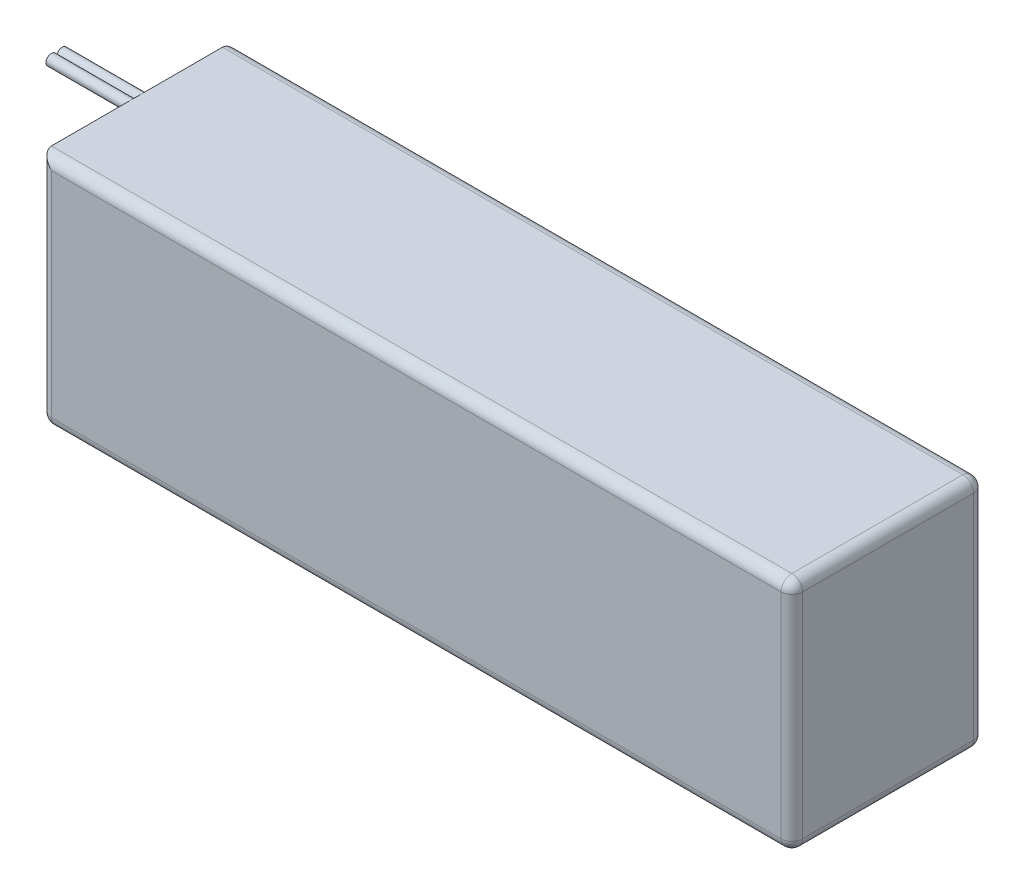
ISO-10303-21;
HEADER;
FILE_DESCRIPTION(('STEP AP214'),'2;1');
FILE_NAME('part.step','',(''),(''),'','','');
FILE_SCHEMA(('AUTOMOTIVE_DESIGN { 1 0 10303 214 1 1 1 1 }'));
ENDSEC;
DATA;
#1=APPLICATION_CONTEXT('core data for automotive mechanical design processes');
#2=APPLICATION_PROTOCOL_DEFINITION('international standard','automotive_design',2000,#1);
#3=PRODUCT_CONTEXT('',#1,'mechanical');
#4=PRODUCT('Part','Part','',(#3));
#5=PRODUCT_RELATED_PRODUCT_CATEGORY('part','',(#4));
#6=PRODUCT_DEFINITION_FORMATION('','',#4);
#7=PRODUCT_DEFINITION_CONTEXT('part definition',#1,'design');
#8=PRODUCT_DEFINITION('design','',#6,#7);
#9=PRODUCT_DEFINITION_SHAPE('','',#8);
#10=(LENGTH_UNIT() NAMED_UNIT(*) SI_UNIT(.MILLI.,.METRE.));
#11=(NAMED_UNIT(*) PLANE_ANGLE_UNIT() SI_UNIT($,.RADIAN.));
#12=(NAMED_UNIT(*) SI_UNIT($,.STERADIAN.) SOLID_ANGLE_UNIT());
#13=UNCERTAINTY_MEASURE_WITH_UNIT(LENGTH_MEASURE(1.E-05),#10,'distance_accuracy_value','');
#14=(GEOMETRIC_REPRESENTATION_CONTEXT(3) GLOBAL_UNCERTAINTY_ASSIGNED_CONTEXT((#13)) GLOBAL_UNIT_ASSIGNED_CONTEXT((#10,
#11,#12)) REPRESENTATION_CONTEXT('',''));
#15=CARTESIAN_POINT('',(0.,0.,0.));
#16=DIRECTION('',(0.,0.,1.));
#17=DIRECTION('',(1.,0.,0.));
#18=AXIS2_PLACEMENT_3D('',#15,#16,#17);
#19=CARTESIAN_POINT('',(-85.25,21.,19.005));
#20=DIRECTION('',(1.,0.,0.));
#21=DIRECTION('',(0.,0.,-1.));
#22=AXIS2_PLACEMENT_3D('',#19,#20,#21);
#23=CYLINDRICAL_SURFACE('',#22,1.);
#24=CARTESIAN_POINT('',(-85.25,21.,19.005));
#25=DIRECTION('',(-1.,0.,0.));
#26=DIRECTION('',(0.,0.,1.));
#27=AXIS2_PLACEMENT_3D('',#24,#25,#26);
#28=CIRCLE('',#27,1.);
#29=CARTESIAN_POINT('',(-85.25,21.,20.005));
#30=VERTEX_POINT('',#29);
#31=EDGE_CURVE('E56',#30,#30,#28,.T.);
#32=ORIENTED_EDGE('',*,*,#31,.F.);
#33=EDGE_LOOP('',(#32));
#34=FACE_BOUND('',#33,.T.);
#35=CARTESIAN_POINT('',(-70.25,21.,19.005));
#36=DIRECTION('',(-1.,0.,0.));
#37=DIRECTION('',(0.,0.,1.));
#38=AXIS2_PLACEMENT_3D('',#35,#36,#37);
#39=CIRCLE('',#38,1.);
#40=CARTESIAN_POINT('',(-70.25,21.,20.005));
#41=VERTEX_POINT('',#40);
#42=EDGE_CURVE('E11',#41,#41,#39,.T.);
#43=ORIENTED_EDGE('',*,*,#42,.T.);
#44=EDGE_LOOP('',(#43));
#45=FACE_BOUND('',#44,.T.);
#46=ADVANCED_FACE('F52',(#34,#45),#23,.T.);
#47=CARTESIAN_POINT('',(-85.25,21.,19.005));
#48=DIRECTION('',(-1.,0.,0.));
#49=DIRECTION('',(0.,0.,1.));
#50=AXIS2_PLACEMENT_3D('',#47,#48,#49);
#51=PLANE('',#50);
#52=ORIENTED_EDGE('',*,*,#31,.T.);
#53=EDGE_LOOP('',(#52));
#54=FACE_BOUND('',#53,.T.);
#55=ADVANCED_FACE('F54',(#54),#51,.T.);
#56=CARTESIAN_POINT('',(-70.25,21.,19.005));
#57=DIRECTION('',(-1.,0.,0.));
#58=DIRECTION('',(0.,0.,1.));
#59=AXIS2_PLACEMENT_3D('',#56,#57,#58);
#60=PLANE('',#59);
#61=ORIENTED_EDGE('',*,*,#42,.F.);
#62=EDGE_LOOP('',(#61));
#63=FACE_BOUND('',#62,.T.);
#64=ADVANCED_FACE('F71',(#63),#60,.F.);
#65=CLOSED_SHELL('',(#46,#55,#64));
#66=MANIFOLD_SOLID_BREP('B2',#65);
#67=CARTESIAN_POINT('',(-85.25,21.,16.995));
#68=DIRECTION('',(1.,0.,0.));
#69=DIRECTION('',(0.,0.,-1.));
#70=AXIS2_PLACEMENT_3D('',#67,#68,#69);
#71=CYLINDRICAL_SURFACE('',#70,1.);
#72=CARTESIAN_POINT('',(-85.25,21.,16.995));
#73=DIRECTION('',(-1.,0.,0.));
#74=DIRECTION('',(0.,0.,1.));
#75=AXIS2_PLACEMENT_3D('',#72,#73,#74);
#76=CIRCLE('',#75,1.);
#77=CARTESIAN_POINT('',(-85.25,21.,17.995));
#78=VERTEX_POINT('',#77);
#79=EDGE_CURVE('E51',#78,#78,#76,.T.);
#80=ORIENTED_EDGE('',*,*,#79,.F.);
#81=EDGE_LOOP('',(#80));
#82=FACE_BOUND('',#81,.T.);
#83=CARTESIAN_POINT('',(-70.25,21.,16.995));
#84=DIRECTION('',(-1.,0.,0.));
#85=DIRECTION('',(0.,0.,1.));
#86=AXIS2_PLACEMENT_3D('',#83,#84,#85);
#87=CIRCLE('',#86,1.);
#88=CARTESIAN_POINT('',(-70.25,21.,17.995));
#89=VERTEX_POINT('',#88);
#90=EDGE_CURVE('E105',#89,#89,#87,.T.);
#91=ORIENTED_EDGE('',*,*,#90,.T.);
#92=EDGE_LOOP('',(#91));
#93=FACE_BOUND('',#92,.T.);
#94=ADVANCED_FACE('F102',(#82,#93),#71,.T.);
#95=CARTESIAN_POINT('',(-85.25,21.,16.995));
#96=DIRECTION('',(-1.,0.,0.));
#97=DIRECTION('',(0.,0.,1.));
#98=AXIS2_PLACEMENT_3D('',#95,#96,#97);
#99=PLANE('',#98);
#100=ORIENTED_EDGE('',*,*,#79,.T.);
#101=EDGE_LOOP('',(#100));
#102=FACE_BOUND('',#101,.T.);
#103=ADVANCED_FACE('F117',(#102),#99,.T.);
#104=CARTESIAN_POINT('',(-70.25,21.,16.995));
#105=DIRECTION('',(-1.,0.,0.));
#106=DIRECTION('',(0.,0.,1.));
#107=AXIS2_PLACEMENT_3D('',#104,#105,#106);
#108=PLANE('',#107);
#109=ORIENTED_EDGE('',*,*,#90,.F.);
#110=EDGE_LOOP('',(#109));
#111=FACE_BOUND('',#110,.T.);
#112=ADVANCED_FACE('F115',(#111),#108,.F.);
#113=CLOSED_SHELL('',(#94,#103,#112));
#114=MANIFOLD_SOLID_BREP('B6',#113);
#115=CARTESIAN_POINT('',(70.25,-22.,36.));
#116=DIRECTION('',(-1.,0.,0.));
#117=DIRECTION('',(0.,0.,1.));
#118=AXIS2_PLACEMENT_3D('',#115,#116,#117);
#119=PLANE('',#118);
#120=DIRECTION('',(0.,0.,-1.));
#121=VECTOR('',#120,1.);
#122=CARTESIAN_POINT('',(70.25,-20.,36.));
#123=LINE('',#122,#121);
#124=CARTESIAN_POINT('',(70.25,-20.,34.));
#125=VERTEX_POINT('',#124);
#126=CARTESIAN_POINT('',(70.25,-20.,2.));
#127=VERTEX_POINT('',#126);
#128=EDGE_CURVE('E245',#125,#127,#123,.T.);
#129=ORIENTED_EDGE('',*,*,#128,.T.);
#130=DIRECTION('',(0.,1.,0.));
#131=VECTOR('',#130,1.);
#132=CARTESIAN_POINT('',(70.25,22.,2.));
#133=LINE('',#132,#131);
#134=CARTESIAN_POINT('',(70.25,20.,2.));
#135=VERTEX_POINT('',#134);
#136=EDGE_CURVE('E282',#127,#135,#133,.T.);
#137=ORIENTED_EDGE('',*,*,#136,.T.);
#138=DIRECTION('',(0.,0.,-1.));
#139=VECTOR('',#138,1.);
#140=CARTESIAN_POINT('',(70.25,20.,36.));
#141=LINE('',#140,#139);
#142=CARTESIAN_POINT('',(70.25,20.,34.));
#143=VERTEX_POINT('',#142);
#144=EDGE_CURVE('E279',#135,#143,#141,.F.);
#145=ORIENTED_EDGE('',*,*,#144,.T.);
#146=DIRECTION('',(0.,1.,0.));
#147=VECTOR('',#146,1.);
#148=CARTESIAN_POINT('',(70.25,-22.,34.));
#149=LINE('',#148,#147);
#150=EDGE_CURVE('E277',#143,#125,#149,.F.);
#151=ORIENTED_EDGE('',*,*,#150,.T.);
#152=EDGE_LOOP('',(#129,#137,#145,#151));
#153=FACE_BOUND('',#152,.T.);
#154=ADVANCED_FACE('F143',(#153),#119,.F.);
#155=CARTESIAN_POINT('',(-70.25,22.,36.));
#156=DIRECTION('',(0.,-1.,0.));
#157=DIRECTION('',(0.,0.,-1.));
#158=AXIS2_PLACEMENT_3D('',#155,#156,#157);
#159=PLANE('',#158);
#160=DIRECTION('',(0.,0.,-1.));
#161=VECTOR('',#160,1.);
#162=CARTESIAN_POINT('',(68.25,22.,36.));
#163=LINE('',#162,#161);
#164=CARTESIAN_POINT('',(68.25,22.,34.));
#165=VERTEX_POINT('',#164);
#166=CARTESIAN_POINT('',(68.25,22.,2.));
#167=VERTEX_POINT('',#166);
#168=EDGE_CURVE('E286',#165,#167,#163,.T.);
#169=ORIENTED_EDGE('',*,*,#168,.T.);
#170=DIRECTION('',(-1.,0.,0.));
#171=VECTOR('',#170,1.);
#172=CARTESIAN_POINT('',(-70.25,22.,2.));
#173=LINE('',#172,#171);
#174=CARTESIAN_POINT('',(-70.25,22.,2.));
#175=VERTEX_POINT('',#174);
#176=EDGE_CURVE('E288',#167,#175,#173,.T.);
#177=ORIENTED_EDGE('',*,*,#176,.T.);
#178=DIRECTION('',(0.,0.,-1.));
#179=VECTOR('',#178,1.);
#180=CARTESIAN_POINT('',(-70.25,22.,36.));
#181=LINE('',#180,#179);
#182=CARTESIAN_POINT('',(-70.25,22.,34.));
#183=VERTEX_POINT('',#182);
#184=EDGE_CURVE('E263',#183,#175,#181,.T.);
#185=ORIENTED_EDGE('',*,*,#184,.F.);
#186=DIRECTION('',(-1.,0.,0.));
#187=VECTOR('',#186,1.);
#188=CARTESIAN_POINT('',(-70.25,22.,34.));
#189=LINE('',#188,#187);
#190=EDGE_CURVE('E284',#183,#165,#189,.F.);
#191=ORIENTED_EDGE('',*,*,#190,.T.);
#192=EDGE_LOOP('',(#169,#177,#185,#191));
#193=FACE_BOUND('',#192,.T.);
#194=ADVANCED_FACE('F396',(#193),#159,.F.);
#195=CARTESIAN_POINT('',(-70.25,-22.,36.));
#196=DIRECTION('',(1.,0.,0.));
#197=DIRECTION('',(0.,0.,-1.));
#198=AXIS2_PLACEMENT_3D('',#195,#196,#197);
#199=PLANE('',#198);
#200=ORIENTED_EDGE('',*,*,#184,.T.);
#201=DIRECTION('',(0.,-1.,0.));
#202=VECTOR('',#201,1.);
#203=CARTESIAN_POINT('',(-70.25,-22.,2.));
#204=LINE('',#203,#202);
#205=CARTESIAN_POINT('',(-70.25,-20.,2.));
#206=VERTEX_POINT('',#205);
#207=EDGE_CURVE('E275',#175,#206,#204,.T.);
#208=ORIENTED_EDGE('',*,*,#207,.T.);
#209=DIRECTION('',(0.,0.,-1.));
#210=VECTOR('',#209,1.);
#211=CARTESIAN_POINT('',(-70.25,-20.,36.));
#212=LINE('',#211,#210);
#213=CARTESIAN_POINT('',(-70.25,-20.,34.));
#214=VERTEX_POINT('',#213);
#215=EDGE_CURVE('E272',#206,#214,#212,.F.);
#216=ORIENTED_EDGE('',*,*,#215,.T.);
#217=DIRECTION('',(0.,-1.,0.));
#218=VECTOR('',#217,1.);
#219=CARTESIAN_POINT('',(-70.25,-22.,34.));
#220=LINE('',#219,#218);
#221=EDGE_CURVE('E270',#214,#183,#220,.F.);
#222=ORIENTED_EDGE('',*,*,#221,.T.);
#223=EDGE_LOOP('',(#200,#208,#216,#222));
#224=FACE_BOUND('',#223,.T.);
#225=ADVANCED_FACE('F393',(#224),#199,.F.);
#226=CARTESIAN_POINT('',(-70.25,-22.,36.));
#227=DIRECTION('',(0.,1.,0.));
#228=DIRECTION('',(0.,0.,1.));
#229=AXIS2_PLACEMENT_3D('',#226,#227,#228);
#230=PLANE('',#229);
#231=DIRECTION('',(0.,0.,-1.));
#232=VECTOR('',#231,1.);
#233=CARTESIAN_POINT('',(-68.25,-22.,36.));
#234=LINE('',#233,#232);
#235=CARTESIAN_POINT('',(-68.25,-22.,34.));
#236=VERTEX_POINT('',#235);
#237=CARTESIAN_POINT('',(-68.25,-22.,2.));
#238=VERTEX_POINT('',#237);
#239=EDGE_CURVE('E237',#236,#238,#234,.T.);
#240=ORIENTED_EDGE('',*,*,#239,.T.);
#241=DIRECTION('',(1.,0.,0.));
#242=VECTOR('',#241,1.);
#243=CARTESIAN_POINT('',(70.25,-22.,2.));
#244=LINE('',#243,#242);
#245=CARTESIAN_POINT('',(68.25,-22.,2.));
#246=VERTEX_POINT('',#245);
#247=EDGE_CURVE('E233',#238,#246,#244,.T.);
#248=ORIENTED_EDGE('',*,*,#247,.T.);
#249=DIRECTION('',(0.,0.,-1.));
#250=VECTOR('',#249,1.);
#251=CARTESIAN_POINT('',(68.25,-22.,36.));
#252=LINE('',#251,#250);
#253=CARTESIAN_POINT('',(68.25,-22.,34.));
#254=VERTEX_POINT('',#253);
#255=EDGE_CURVE('E225',#246,#254,#252,.F.);
#256=ORIENTED_EDGE('',*,*,#255,.T.);
#257=DIRECTION('',(1.,0.,0.));
#258=VECTOR('',#257,1.);
#259=CARTESIAN_POINT('',(-70.25,-22.,34.));
#260=LINE('',#259,#258);
#261=EDGE_CURVE('E230',#254,#236,#260,.F.);
#262=ORIENTED_EDGE('',*,*,#261,.T.);
#263=EDGE_LOOP('',(#240,#248,#256,#262));
#264=FACE_BOUND('',#263,.T.);
#265=ADVANCED_FACE('F228',(#264),#230,.F.);
#266=CARTESIAN_POINT('',(0.,0.,36.));
#267=DIRECTION('',(0.,0.,-1.));
#268=DIRECTION('',(-1.,0.,0.));
#269=AXIS2_PLACEMENT_3D('',#266,#267,#268);
#270=PLANE('',#269);
#271=DIRECTION('',(0.,-1.,0.));
#272=VECTOR('',#271,1.);
#273=CARTESIAN_POINT('',(-68.25,0.,36.));
#274=LINE('',#273,#272);
#275=CARTESIAN_POINT('',(-68.25,20.,36.));
#276=VERTEX_POINT('',#275);
#277=CARTESIAN_POINT('',(-68.25,-20.,36.));
#278=VERTEX_POINT('',#277);
#279=EDGE_CURVE('E152',#276,#278,#274,.T.);
#280=ORIENTED_EDGE('',*,*,#279,.T.);
#281=DIRECTION('',(1.,0.,0.));
#282=VECTOR('',#281,1.);
#283=CARTESIAN_POINT('',(0.,-20.,36.));
#284=LINE('',#283,#282);
#285=CARTESIAN_POINT('',(68.25,-20.,36.));
#286=VERTEX_POINT('',#285);
#287=EDGE_CURVE('E100',#278,#286,#284,.T.);
#288=ORIENTED_EDGE('',*,*,#287,.T.);
#289=DIRECTION('',(0.,1.,0.));
#290=VECTOR('',#289,1.);
#291=CARTESIAN_POINT('',(68.25,0.,36.));
#292=LINE('',#291,#290);
#293=CARTESIAN_POINT('',(68.25,20.,36.));
#294=VERTEX_POINT('',#293);
#295=EDGE_CURVE('E299',#286,#294,#292,.T.);
#296=ORIENTED_EDGE('',*,*,#295,.T.);
#297=DIRECTION('',(-1.,0.,0.));
#298=VECTOR('',#297,1.);
#299=CARTESIAN_POINT('',(0.,20.,36.));
#300=LINE('',#299,#298);
#301=EDGE_CURVE('E163',#294,#276,#300,.T.);
#302=ORIENTED_EDGE('',*,*,#301,.T.);
#303=EDGE_LOOP('',(#280,#288,#296,#302));
#304=FACE_BOUND('',#303,.T.);
#305=ADVANCED_FACE('F383',(#304),#270,.F.);
#306=CARTESIAN_POINT('',(0.,0.,0.));
#307=DIRECTION('',(0.,0.,-1.));
#308=DIRECTION('',(-1.,0.,0.));
#309=AXIS2_PLACEMENT_3D('',#306,#307,#308);
#310=PLANE('',#309);
#311=DIRECTION('',(0.,-1.,0.));
#312=VECTOR('',#311,1.);
#313=CARTESIAN_POINT('',(-68.25,22.,0.));
#314=LINE('',#313,#312);
#315=CARTESIAN_POINT('',(-68.25,-20.,0.));
#316=VERTEX_POINT('',#315);
#317=CARTESIAN_POINT('',(-68.25,20.,0.));
#318=VERTEX_POINT('',#317);
#319=EDGE_CURVE('E294',#316,#318,#314,.F.);
#320=ORIENTED_EDGE('',*,*,#319,.T.);
#321=DIRECTION('',(-1.,0.,0.));
#322=VECTOR('',#321,1.);
#323=CARTESIAN_POINT('',(70.25,20.,0.));
#324=LINE('',#323,#322);
#325=CARTESIAN_POINT('',(68.25,20.,0.));
#326=VERTEX_POINT('',#325);
#327=EDGE_CURVE('E296',#318,#326,#324,.F.);
#328=ORIENTED_EDGE('',*,*,#327,.T.);
#329=DIRECTION('',(0.,1.,0.));
#330=VECTOR('',#329,1.);
#331=CARTESIAN_POINT('',(68.25,-22.,0.));
#332=LINE('',#331,#330);
#333=CARTESIAN_POINT('',(68.25,-20.,0.));
#334=VERTEX_POINT('',#333);
#335=EDGE_CURVE('E290',#326,#334,#332,.F.);
#336=ORIENTED_EDGE('',*,*,#335,.T.);
#337=DIRECTION('',(1.,0.,0.));
#338=VECTOR('',#337,1.);
#339=CARTESIAN_POINT('',(-70.25,-20.,0.));
#340=LINE('',#339,#338);
#341=EDGE_CURVE('E292',#334,#316,#340,.F.);
#342=ORIENTED_EDGE('',*,*,#341,.T.);
#343=EDGE_LOOP('',(#320,#328,#336,#342));
#344=FACE_BOUND('',#343,.T.);
#345=ADVANCED_FACE('F385',(#344),#310,.T.);
#346=CARTESIAN_POINT('',(68.25,20.,36.));
#347=DIRECTION('',(0.,0.,-1.));
#348=DIRECTION('',(-1.,0.,0.));
#349=AXIS2_PLACEMENT_3D('',#346,#347,#348);
#350=CYLINDRICAL_SURFACE('',#349,2.);
#351=CARTESIAN_POINT('',(68.25,20.,34.));
#352=DIRECTION('',(0.,0.,1.));
#353=DIRECTION('',(1.,0.,0.));
#354=AXIS2_PLACEMENT_3D('',#351,#352,#353);
#355=CIRCLE('',#354,2.);
#356=EDGE_CURVE('E147',#143,#165,#355,.T.);
#357=ORIENTED_EDGE('',*,*,#356,.F.);
#358=ORIENTED_EDGE('',*,*,#144,.F.);
#359=CARTESIAN_POINT('',(68.25,20.,2.));
#360=DIRECTION('',(0.,0.,-1.));
#361=DIRECTION('',(-1.,0.,0.));
#362=AXIS2_PLACEMENT_3D('',#359,#360,#361);
#363=CIRCLE('',#362,2.);
#364=EDGE_CURVE('E333',#167,#135,#363,.T.);
#365=ORIENTED_EDGE('',*,*,#364,.F.);
#366=ORIENTED_EDGE('',*,*,#168,.F.);
#367=EDGE_LOOP('',(#357,#358,#365,#366));
#368=FACE_BOUND('',#367,.T.);
#369=ADVANCED_FACE('F145',(#368),#350,.T.);
#370=CARTESIAN_POINT('',(68.25,20.,34.));
#371=DIRECTION('',(1.,0.,0.));
#372=DIRECTION('',(0.,0.,-1.));
#373=AXIS2_PLACEMENT_3D('',#370,#371,#372);
#374=SPHERICAL_SURFACE('',#373,2.);
#375=CARTESIAN_POINT('',(68.25,20.,34.));
#376=DIRECTION('',(1.,0.,0.));
#377=DIRECTION('',(0.,0.,-1.));
#378=AXIS2_PLACEMENT_3D('',#375,#376,#377);
#379=CIRCLE('',#378,2.);
#380=EDGE_CURVE('E330',#294,#165,#379,.F.);
#381=ORIENTED_EDGE('',*,*,#380,.F.);
#382=CARTESIAN_POINT('',(68.25,20.,34.));
#383=DIRECTION('',(0.,1.,0.));
#384=DIRECTION('',(0.,0.,1.));
#385=AXIS2_PLACEMENT_3D('',#382,#383,#384);
#386=CIRCLE('',#385,2.);
#387=EDGE_CURVE('E338',#143,#294,#386,.F.);
#388=ORIENTED_EDGE('',*,*,#387,.F.);
#389=ORIENTED_EDGE('',*,*,#356,.T.);
#390=EDGE_LOOP('',(#381,#388,#389));
#391=FACE_BOUND('',#390,.T.);
#392=ADVANCED_FACE('F347',(#391),#374,.T.);
#393=CARTESIAN_POINT('',(68.25,0.,34.));
#394=DIRECTION('',(0.,1.,0.));
#395=DIRECTION('',(0.,0.,1.));
#396=AXIS2_PLACEMENT_3D('',#393,#394,#395);
#397=CYLINDRICAL_SURFACE('',#396,2.);
#398=ORIENTED_EDGE('',*,*,#387,.T.);
#399=ORIENTED_EDGE('',*,*,#295,.F.);
#400=CARTESIAN_POINT('',(68.25,-20.,34.));
#401=DIRECTION('',(0.,-1.,0.));
#402=DIRECTION('',(0.,0.,-1.));
#403=AXIS2_PLACEMENT_3D('',#400,#401,#402);
#404=CIRCLE('',#403,2.);
#405=EDGE_CURVE('E249',#125,#286,#404,.T.);
#406=ORIENTED_EDGE('',*,*,#405,.F.);
#407=ORIENTED_EDGE('',*,*,#150,.F.);
#408=EDGE_LOOP('',(#398,#399,#406,#407));
#409=FACE_BOUND('',#408,.T.);
#410=ADVANCED_FACE('F382',(#409),#397,.T.);
#411=CARTESIAN_POINT('',(68.25,-20.,36.));
#412=DIRECTION('',(0.,0.,-1.));
#413=DIRECTION('',(-1.,0.,0.));
#414=AXIS2_PLACEMENT_3D('',#411,#412,#413);
#415=CYLINDRICAL_SURFACE('',#414,2.);
#416=CARTESIAN_POINT('',(68.25,-20.,2.));
#417=DIRECTION('',(0.,0.,-1.));
#418=DIRECTION('',(-1.,0.,0.));
#419=AXIS2_PLACEMENT_3D('',#416,#417,#418);
#420=CIRCLE('',#419,2.);
#421=EDGE_CURVE('E250',#127,#246,#420,.T.);
#422=ORIENTED_EDGE('',*,*,#421,.F.);
#423=ORIENTED_EDGE('',*,*,#128,.F.);
#424=CARTESIAN_POINT('',(68.25,-20.,34.));
#425=DIRECTION('',(0.,0.,1.));
#426=DIRECTION('',(1.,0.,0.));
#427=AXIS2_PLACEMENT_3D('',#424,#425,#426);
#428=CIRCLE('',#427,2.);
#429=EDGE_CURVE('E241',#254,#125,#428,.T.);
#430=ORIENTED_EDGE('',*,*,#429,.F.);
#431=ORIENTED_EDGE('',*,*,#255,.F.);
#432=EDGE_LOOP('',(#422,#423,#430,#431));
#433=FACE_BOUND('',#432,.T.);
#434=ADVANCED_FACE('F243',(#433),#415,.T.);
#435=CARTESIAN_POINT('',(68.25,-22.,2.));
#436=DIRECTION('',(0.,-1.,0.));
#437=DIRECTION('',(0.,0.,-1.));
#438=AXIS2_PLACEMENT_3D('',#435,#436,#437);
#439=CYLINDRICAL_SURFACE('',#438,2.);
#440=CARTESIAN_POINT('',(68.25,20.,2.));
#441=DIRECTION('',(0.,1.,0.));
#442=DIRECTION('',(0.,0.,1.));
#443=AXIS2_PLACEMENT_3D('',#440,#441,#442);
#444=CIRCLE('',#443,2.);
#445=EDGE_CURVE('E336',#135,#326,#444,.T.);
#446=ORIENTED_EDGE('',*,*,#445,.F.);
#447=ORIENTED_EDGE('',*,*,#136,.F.);
#448=CARTESIAN_POINT('',(68.25,-20.,2.));
#449=DIRECTION('',(0.,-1.,0.));
#450=DIRECTION('',(0.,0.,-1.));
#451=AXIS2_PLACEMENT_3D('',#448,#449,#450);
#452=CIRCLE('',#451,2.);
#453=EDGE_CURVE('E326',#334,#127,#452,.T.);
#454=ORIENTED_EDGE('',*,*,#453,.F.);
#455=ORIENTED_EDGE('',*,*,#335,.F.);
#456=EDGE_LOOP('',(#446,#447,#454,#455));
#457=FACE_BOUND('',#456,.T.);
#458=ADVANCED_FACE('F379',(#457),#439,.T.);
#459=CARTESIAN_POINT('',(68.25,20.,2.));
#460=DIRECTION('',(1.,0.,0.));
#461=DIRECTION('',(0.,0.,-1.));
#462=AXIS2_PLACEMENT_3D('',#459,#460,#461);
#463=SPHERICAL_SURFACE('',#462,2.);
#464=ORIENTED_EDGE('',*,*,#364,.T.);
#465=ORIENTED_EDGE('',*,*,#445,.T.);
#466=CARTESIAN_POINT('',(68.25,20.,2.));
#467=DIRECTION('',(1.,0.,0.));
#468=DIRECTION('',(0.,0.,-1.));
#469=AXIS2_PLACEMENT_3D('',#466,#467,#468);
#470=CIRCLE('',#469,2.);
#471=EDGE_CURVE('E324',#167,#326,#470,.F.);
#472=ORIENTED_EDGE('',*,*,#471,.F.);
#473=EDGE_LOOP('',(#464,#465,#472));
#474=FACE_BOUND('',#473,.T.);
#475=ADVANCED_FACE('F431',(#474),#463,.T.);
#476=CARTESIAN_POINT('',(0.,20.,34.));
#477=DIRECTION('',(-1.,0.,0.));
#478=DIRECTION('',(0.,0.,1.));
#479=AXIS2_PLACEMENT_3D('',#476,#477,#478);
#480=CYLINDRICAL_SURFACE('',#479,2.);
#481=ORIENTED_EDGE('',*,*,#380,.T.);
#482=ORIENTED_EDGE('',*,*,#190,.F.);
#483=CARTESIAN_POINT('',(-68.25,20.,34.));
#484=DIRECTION('',(-0.707106781186547,-0.707106781186547,0.));
#485=DIRECTION('',(-0.707106781186547,0.707106781186547,0.));
#486=AXIS2_PLACEMENT_3D('',#483,#484,#485);
#487=ELLIPSE('',#486,2.82842712474619,2.);
#488=EDGE_CURVE('E256',#276,#183,#487,.T.);
#489=ORIENTED_EDGE('',*,*,#488,.F.);
#490=ORIENTED_EDGE('',*,*,#301,.F.);
#491=EDGE_LOOP('',(#481,#482,#489,#490));
#492=FACE_BOUND('',#491,.T.);
#493=ADVANCED_FACE('F353',(#492),#480,.T.);
#494=CARTESIAN_POINT('',(68.25,-20.,34.));
#495=DIRECTION('',(1.,0.,0.));
#496=DIRECTION('',(0.,0.,-1.));
#497=AXIS2_PLACEMENT_3D('',#494,#495,#496);
#498=SPHERICAL_SURFACE('',#497,2.);
#499=ORIENTED_EDGE('',*,*,#429,.T.);
#500=ORIENTED_EDGE('',*,*,#405,.T.);
#501=CARTESIAN_POINT('',(68.25,-20.,34.));
#502=DIRECTION('',(1.,0.,0.));
#503=DIRECTION('',(0.,0.,-1.));
#504=AXIS2_PLACEMENT_3D('',#501,#502,#503);
#505=CIRCLE('',#504,2.);
#506=EDGE_CURVE('E252',#254,#286,#505,.F.);
#507=ORIENTED_EDGE('',*,*,#506,.F.);
#508=EDGE_LOOP('',(#499,#500,#507));
#509=FACE_BOUND('',#508,.T.);
#510=ADVANCED_FACE('F253',(#509),#498,.T.);
#511=CARTESIAN_POINT('',(68.25,-20.,2.));
#512=DIRECTION('',(1.,0.,0.));
#513=DIRECTION('',(0.,0.,-1.));
#514=AXIS2_PLACEMENT_3D('',#511,#512,#513);
#515=SPHERICAL_SURFACE('',#514,2.);
#516=ORIENTED_EDGE('',*,*,#453,.T.);
#517=ORIENTED_EDGE('',*,*,#421,.T.);
#518=CARTESIAN_POINT('',(68.25,-20.,2.));
#519=DIRECTION('',(1.,0.,0.));
#520=DIRECTION('',(0.,0.,-1.));
#521=AXIS2_PLACEMENT_3D('',#518,#519,#520);
#522=CIRCLE('',#521,2.);
#523=EDGE_CURVE('E257',#334,#246,#522,.F.);
#524=ORIENTED_EDGE('',*,*,#523,.F.);
#525=EDGE_LOOP('',(#516,#517,#524));
#526=FACE_BOUND('',#525,.T.);
#527=ADVANCED_FACE('F374',(#526),#515,.T.);
#528=CARTESIAN_POINT('',(-70.25,20.,2.));
#529=DIRECTION('',(1.,0.,0.));
#530=DIRECTION('',(0.,0.,-1.));
#531=AXIS2_PLACEMENT_3D('',#528,#529,#530);
#532=CYLINDRICAL_SURFACE('',#531,2.);
#533=ORIENTED_EDGE('',*,*,#471,.T.);
#534=ORIENTED_EDGE('',*,*,#327,.F.);
#535=CARTESIAN_POINT('',(-68.25,20.,2.));
#536=DIRECTION('',(0.707106781186547,0.707106781186547,0.));
#537=DIRECTION('',(-0.707106781186547,0.707106781186547,0.));
#538=AXIS2_PLACEMENT_3D('',#535,#536,#537);
#539=ELLIPSE('',#538,2.82842712474619,2.);
#540=EDGE_CURVE('E317',#175,#318,#539,.F.);
#541=ORIENTED_EDGE('',*,*,#540,.F.);
#542=ORIENTED_EDGE('',*,*,#176,.F.);
#543=EDGE_LOOP('',(#533,#534,#541,#542));
#544=FACE_BOUND('',#543,.T.);
#545=ADVANCED_FACE('F421',(#544),#532,.T.);
#546=CARTESIAN_POINT('',(-68.25,0.,34.));
#547=DIRECTION('',(0.,-1.,0.));
#548=DIRECTION('',(0.,0.,-1.));
#549=AXIS2_PLACEMENT_3D('',#546,#547,#548);
#550=CYLINDRICAL_SURFACE('',#549,2.);
#551=ORIENTED_EDGE('',*,*,#488,.T.);
#552=ORIENTED_EDGE('',*,*,#221,.F.);
#553=CARTESIAN_POINT('',(-68.25,-20.,34.));
#554=DIRECTION('',(0.,-1.,0.));
#555=DIRECTION('',(0.,0.,-1.));
#556=AXIS2_PLACEMENT_3D('',#553,#554,#555);
#557=CIRCLE('',#556,2.);
#558=EDGE_CURVE('E314',#278,#214,#557,.T.);
#559=ORIENTED_EDGE('',*,*,#558,.F.);
#560=ORIENTED_EDGE('',*,*,#279,.F.);
#561=EDGE_LOOP('',(#551,#552,#559,#560));
#562=FACE_BOUND('',#561,.T.);
#563=ADVANCED_FACE('F357',(#562),#550,.T.);
#564=CARTESIAN_POINT('',(0.,-20.,34.));
#565=DIRECTION('',(1.,0.,0.));
#566=DIRECTION('',(0.,0.,-1.));
#567=AXIS2_PLACEMENT_3D('',#564,#565,#566);
#568=CYLINDRICAL_SURFACE('',#567,2.);
#569=ORIENTED_EDGE('',*,*,#506,.T.);
#570=ORIENTED_EDGE('',*,*,#287,.F.);
#571=CARTESIAN_POINT('',(-68.25,-20.,34.));
#572=DIRECTION('',(-1.,0.,0.));
#573=DIRECTION('',(0.,0.,1.));
#574=AXIS2_PLACEMENT_3D('',#571,#572,#573);
#575=CIRCLE('',#574,2.);
#576=EDGE_CURVE('E261',#236,#278,#575,.T.);
#577=ORIENTED_EDGE('',*,*,#576,.F.);
#578=ORIENTED_EDGE('',*,*,#261,.F.);
#579=EDGE_LOOP('',(#569,#570,#577,#578));
#580=FACE_BOUND('',#579,.T.);
#581=ADVANCED_FACE('F259',(#580),#568,.T.);
#582=CARTESIAN_POINT('',(-70.25,-20.,2.));
#583=DIRECTION('',(-1.,0.,0.));
#584=DIRECTION('',(0.,0.,1.));
#585=AXIS2_PLACEMENT_3D('',#582,#583,#584);
#586=CYLINDRICAL_SURFACE('',#585,2.);
#587=ORIENTED_EDGE('',*,*,#523,.T.);
#588=ORIENTED_EDGE('',*,*,#247,.F.);
#589=CARTESIAN_POINT('',(-68.25,-20.,2.));
#590=DIRECTION('',(-1.,0.,0.));
#591=DIRECTION('',(0.,0.,1.));
#592=AXIS2_PLACEMENT_3D('',#589,#590,#591);
#593=CIRCLE('',#592,2.);
#594=EDGE_CURVE('E310',#316,#238,#593,.T.);
#595=ORIENTED_EDGE('',*,*,#594,.F.);
#596=ORIENTED_EDGE('',*,*,#341,.F.);
#597=EDGE_LOOP('',(#587,#588,#595,#596));
#598=FACE_BOUND('',#597,.T.);
#599=ADVANCED_FACE('F371',(#598),#586,.T.);
#600=CARTESIAN_POINT('',(-68.25,-22.,2.));
#601=DIRECTION('',(0.,1.,0.));
#602=DIRECTION('',(0.,0.,1.));
#603=AXIS2_PLACEMENT_3D('',#600,#601,#602);
#604=CYLINDRICAL_SURFACE('',#603,2.);
#605=ORIENTED_EDGE('',*,*,#540,.T.);
#606=ORIENTED_EDGE('',*,*,#319,.F.);
#607=CARTESIAN_POINT('',(-68.25,-20.,2.));
#608=DIRECTION('',(0.,-1.,0.));
#609=DIRECTION('',(0.,0.,-1.));
#610=AXIS2_PLACEMENT_3D('',#607,#608,#609);
#611=CIRCLE('',#610,2.);
#612=EDGE_CURVE('E307',#206,#316,#611,.T.);
#613=ORIENTED_EDGE('',*,*,#612,.F.);
#614=ORIENTED_EDGE('',*,*,#207,.F.);
#615=EDGE_LOOP('',(#605,#606,#613,#614));
#616=FACE_BOUND('',#615,.T.);
#617=ADVANCED_FACE('F411',(#616),#604,.T.);
#618=CARTESIAN_POINT('',(-68.25,-20.,34.));
#619=DIRECTION('',(0.,0.,1.));
#620=DIRECTION('',(1.,0.,0.));
#621=AXIS2_PLACEMENT_3D('',#618,#619,#620);
#622=SPHERICAL_SURFACE('',#621,2.);
#623=ORIENTED_EDGE('',*,*,#576,.T.);
#624=ORIENTED_EDGE('',*,*,#558,.T.);
#625=CARTESIAN_POINT('',(-68.25,-20.,34.));
#626=DIRECTION('',(0.,0.,1.));
#627=DIRECTION('',(1.,0.,0.));
#628=AXIS2_PLACEMENT_3D('',#625,#626,#627);
#629=CIRCLE('',#628,2.);
#630=EDGE_CURVE('E305',#236,#214,#629,.F.);
#631=ORIENTED_EDGE('',*,*,#630,.F.);
#632=EDGE_LOOP('',(#623,#624,#631));
#633=FACE_BOUND('',#632,.T.);
#634=ADVANCED_FACE('F359',(#633),#622,.T.);
#635=CARTESIAN_POINT('',(-68.25,-20.,2.));
#636=DIRECTION('',(0.,0.,-1.));
#637=DIRECTION('',(-1.,0.,0.));
#638=AXIS2_PLACEMENT_3D('',#635,#636,#637);
#639=SPHERICAL_SURFACE('',#638,2.);
#640=ORIENTED_EDGE('',*,*,#612,.T.);
#641=ORIENTED_EDGE('',*,*,#594,.T.);
#642=CARTESIAN_POINT('',(-68.25,-20.,2.));
#643=DIRECTION('',(0.,0.,-1.));
#644=DIRECTION('',(-1.,0.,0.));
#645=AXIS2_PLACEMENT_3D('',#642,#643,#644);
#646=CIRCLE('',#645,2.);
#647=EDGE_CURVE('E303',#206,#238,#646,.F.);
#648=ORIENTED_EDGE('',*,*,#647,.F.);
#649=EDGE_LOOP('',(#640,#641,#648));
#650=FACE_BOUND('',#649,.T.);
#651=ADVANCED_FACE('F367',(#650),#639,.T.);
#652=CARTESIAN_POINT('',(-68.25,-20.,36.));
#653=DIRECTION('',(0.,0.,-1.));
#654=DIRECTION('',(-1.,0.,0.));
#655=AXIS2_PLACEMENT_3D('',#652,#653,#654);
#656=CYLINDRICAL_SURFACE('',#655,2.);
#657=ORIENTED_EDGE('',*,*,#630,.T.);
#658=ORIENTED_EDGE('',*,*,#215,.F.);
#659=ORIENTED_EDGE('',*,*,#647,.T.);
#660=ORIENTED_EDGE('',*,*,#239,.F.);
#661=EDGE_LOOP('',(#657,#658,#659,#660));
#662=FACE_BOUND('',#661,.T.);
#663=ADVANCED_FACE('F363',(#662),#656,.T.);
#664=CLOSED_SHELL('',(#154,#194,#225,#265,#305,#345,#369,#392,#410,#434,#458,#475,#493,#510,
#527,#545,#563,#581,#599,#617,#634,#651,#663));
#665=MANIFOLD_SOLID_BREP('B46',#664);
#666=ADVANCED_BREP_SHAPE_REPRESENTATION('',(#18,#66,#114,#665),#14);
#667=SHAPE_DEFINITION_REPRESENTATION(#9,#666);
ENDSEC;
END-ISO-10303-21;
